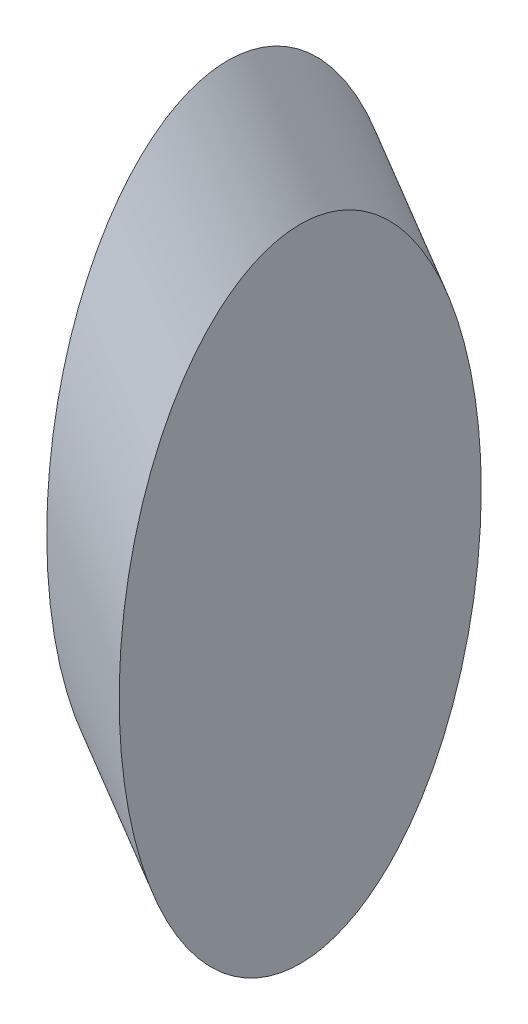
ISO-10303-21;
HEADER;
FILE_DESCRIPTION(('STEP AP214'),'2;1');
FILE_NAME('part.step','',(''),(''),'','','');
FILE_SCHEMA(('AUTOMOTIVE_DESIGN { 1 0 10303 214 1 1 1 1 }'));
ENDSEC;
DATA;
#1=APPLICATION_CONTEXT('core data for automotive mechanical design processes');
#2=APPLICATION_PROTOCOL_DEFINITION('international standard','automotive_design',2000,#1);
#3=PRODUCT_CONTEXT('',#1,'mechanical');
#4=PRODUCT('Part','Part','',(#3));
#5=PRODUCT_RELATED_PRODUCT_CATEGORY('part','',(#4));
#6=PRODUCT_DEFINITION_FORMATION('','',#4);
#7=PRODUCT_DEFINITION_CONTEXT('part definition',#1,'design');
#8=PRODUCT_DEFINITION('design','',#6,#7);
#9=PRODUCT_DEFINITION_SHAPE('','',#8);
#10=(LENGTH_UNIT() NAMED_UNIT(*) SI_UNIT(.MILLI.,.METRE.));
#11=(NAMED_UNIT(*) PLANE_ANGLE_UNIT() SI_UNIT($,.RADIAN.));
#12=(NAMED_UNIT(*) SI_UNIT($,.STERADIAN.) SOLID_ANGLE_UNIT());
#13=UNCERTAINTY_MEASURE_WITH_UNIT(LENGTH_MEASURE(1.E-05),#10,'distance_accuracy_value','');
#14=(GEOMETRIC_REPRESENTATION_CONTEXT(3) GLOBAL_UNCERTAINTY_ASSIGNED_CONTEXT((#13)) GLOBAL_UNIT_ASSIGNED_CONTEXT((#10,
#11,#12)) REPRESENTATION_CONTEXT('',''));
#15=CARTESIAN_POINT('',(0.,0.,0.));
#16=DIRECTION('',(0.,0.,1.));
#17=DIRECTION('',(1.,0.,0.));
#18=AXIS2_PLACEMENT_3D('',#15,#16,#17);
#19=CARTESIAN_POINT('',(0.999999999999995,7.38392063899019,-5.));
#20=DIRECTION('',(1.,0.,0.));
#21=DIRECTION('',(0.,1.,0.));
#22=AXIS2_PLACEMENT_3D('',#19,#20,#21);
#23=PLANE('',#22);
#24=CARTESIAN_POINT('',(1.,-1.45864203475964,0.));
#25=DIRECTION('',(1.,0.,0.));
#26=DIRECTION('',(0.,1.,0.));
#27=AXIS2_PLACEMENT_3D('',#24,#25,#26);
#28=ELLIPSE('',#27,8.84256267374983,5.);
#29=CARTESIAN_POINT('',(0.999999999999999,7.38392063899019,0.));
#30=VERTEX_POINT('',#29);
#31=EDGE_CURVE('E17',#30,#30,#28,.F.);
#32=ORIENTED_EDGE('',*,*,#31,.F.);
#33=EDGE_LOOP('',(#32));
#34=FACE_BOUND('',#33,.T.);
#35=ADVANCED_FACE('F14',(#34),#23,.T.);
#36=CARTESIAN_POINT('',(28.272346968165,-41.2392337090748,0.));
#37=DIRECTION('',(-0.5654469393633,0.824784674181496,0.));
#38=DIRECTION('',(-0.824784674181496,-0.5654469393633,0.));
#39=AXIS2_PLACEMENT_3D('',#36,#37,#38);
#40=CYLINDRICAL_SURFACE('',#39,5.);
#41=ORIENTED_EDGE('',*,*,#31,.T.);
#42=EDGE_LOOP('',(#41));
#43=FACE_BOUND('',#42,.T.);
#44=CARTESIAN_POINT('',(-1.,1.45864203475964,0.));
#45=DIRECTION('',(-1.,0.,0.));
#46=DIRECTION('',(0.,1.,0.));
#47=AXIS2_PLACEMENT_3D('',#44,#45,#46);
#48=ELLIPSE('',#47,8.84256267374983,5.);
#49=CARTESIAN_POINT('',(-1.,10.3012047085095,0.));
#50=VERTEX_POINT('',#49);
#51=EDGE_CURVE('E8',#50,#50,#48,.T.);
#52=ORIENTED_EDGE('',*,*,#51,.F.);
#53=EDGE_LOOP('',(#52));
#54=FACE_BOUND('',#53,.T.);
#55=ADVANCED_FACE('F26',(#43,#54),#40,.T.);
#56=CARTESIAN_POINT('',(-1.,10.3012047085095,-5.));
#57=DIRECTION('',(-1.,0.,0.));
#58=DIRECTION('',(0.,0.,1.));
#59=AXIS2_PLACEMENT_3D('',#56,#57,#58);
#60=PLANE('',#59);
#61=ORIENTED_EDGE('',*,*,#51,.T.);
#62=EDGE_LOOP('',(#61));
#63=FACE_BOUND('',#62,.T.);
#64=ADVANCED_FACE('F33',(#63),#60,.T.);
#65=CLOSED_SHELL('',(#35,#55,#64));
#66=MANIFOLD_SOLID_BREP('B1',#65);
#67=ADVANCED_BREP_SHAPE_REPRESENTATION('',(#18,#66),#14);
#68=SHAPE_DEFINITION_REPRESENTATION(#9,#67);
ENDSEC;
END-ISO-10303-21;
